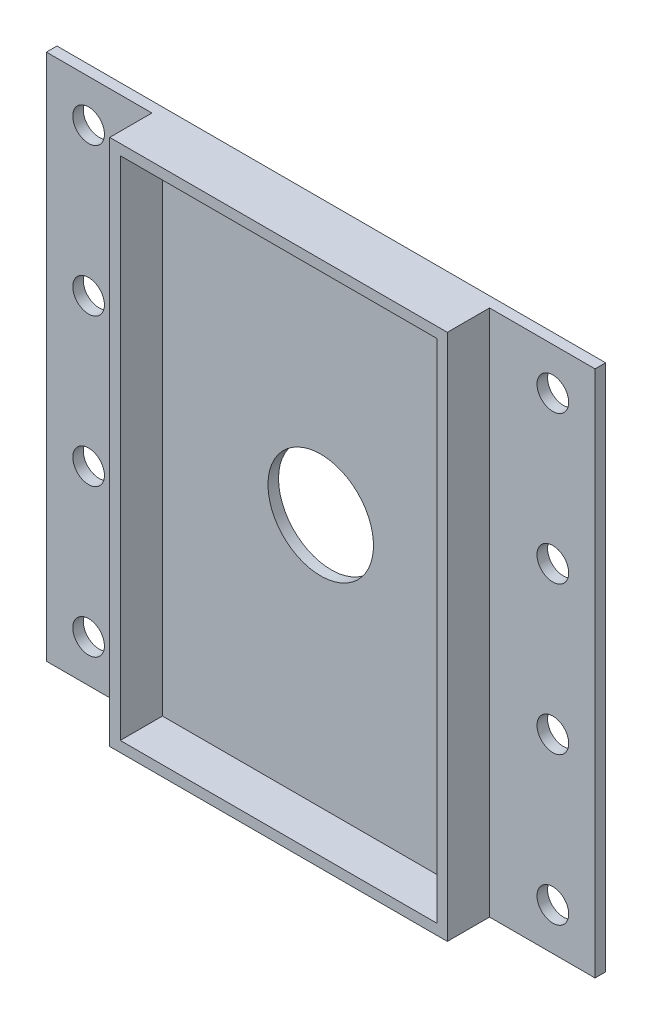
ISO-10303-21;
HEADER;
FILE_DESCRIPTION(('STEP AP214'),'2;1');
FILE_NAME('part.step','',(''),(''),'','','');
FILE_SCHEMA(('AUTOMOTIVE_DESIGN { 1 0 10303 214 1 1 1 1 }'));
ENDSEC;
DATA;
#1=APPLICATION_CONTEXT('core data for automotive mechanical design processes');
#2=APPLICATION_PROTOCOL_DEFINITION('international standard','automotive_design',2000,#1);
#3=PRODUCT_CONTEXT('',#1,'mechanical');
#4=PRODUCT('Part','Part','',(#3));
#5=PRODUCT_RELATED_PRODUCT_CATEGORY('part','',(#4));
#6=PRODUCT_DEFINITION_FORMATION('','',#4);
#7=PRODUCT_DEFINITION_CONTEXT('part definition',#1,'design');
#8=PRODUCT_DEFINITION('design','',#6,#7);
#9=PRODUCT_DEFINITION_SHAPE('','',#8);
#10=(LENGTH_UNIT() NAMED_UNIT(*) SI_UNIT(.MILLI.,.METRE.));
#11=(NAMED_UNIT(*) PLANE_ANGLE_UNIT() SI_UNIT($,.RADIAN.));
#12=(NAMED_UNIT(*) SI_UNIT($,.STERADIAN.) SOLID_ANGLE_UNIT());
#13=UNCERTAINTY_MEASURE_WITH_UNIT(LENGTH_MEASURE(1.E-05),#10,'distance_accuracy_value','');
#14=(GEOMETRIC_REPRESENTATION_CONTEXT(3) GLOBAL_UNCERTAINTY_ASSIGNED_CONTEXT((#13)) GLOBAL_UNIT_ASSIGNED_CONTEXT((#10,
#11,#12)) REPRESENTATION_CONTEXT('',''));
#15=CARTESIAN_POINT('',(0.,0.,0.));
#16=DIRECTION('',(0.,0.,1.));
#17=DIRECTION('',(1.,0.,0.));
#18=AXIS2_PLACEMENT_3D('',#15,#16,#17);
#19=CARTESIAN_POINT('',(0.,0.,20.));
#20=DIRECTION('',(0.,0.,1.));
#21=DIRECTION('',(1.,0.,0.));
#22=AXIS2_PLACEMENT_3D('',#19,#20,#21);
#23=PLANE('',#22);
#24=DIRECTION('',(0.,1.,0.));
#25=VECTOR('',#24,1.);
#26=CARTESIAN_POINT('',(0.,0.,20.));
#27=LINE('',#26,#25);
#28=CARTESIAN_POINT('',(0.,0.,20.));
#29=VERTEX_POINT('',#28);
#30=CARTESIAN_POINT('',(0.,250.,20.));
#31=VERTEX_POINT('',#30);
#32=EDGE_CURVE('E102',#29,#31,#27,.T.);
#33=ORIENTED_EDGE('',*,*,#32,.T.);
#34=DIRECTION('',(-1.,0.,0.));
#35=VECTOR('',#34,1.);
#36=CARTESIAN_POINT('',(0.,250.,20.));
#37=LINE('',#36,#35);
#38=CARTESIAN_POINT('',(-160.,250.,20.));
#39=VERTEX_POINT('',#38);
#40=EDGE_CURVE('E95',#31,#39,#37,.T.);
#41=ORIENTED_EDGE('',*,*,#40,.T.);
#42=DIRECTION('',(0.,-1.,0.));
#43=VECTOR('',#42,1.);
#44=CARTESIAN_POINT('',(-160.,0.,20.));
#45=LINE('',#44,#43);
#46=CARTESIAN_POINT('',(-160.,0.,20.));
#47=VERTEX_POINT('',#46);
#48=EDGE_CURVE('E99',#39,#47,#45,.T.);
#49=ORIENTED_EDGE('',*,*,#48,.T.);
#50=DIRECTION('',(1.,0.,0.));
#51=VECTOR('',#50,1.);
#52=CARTESIAN_POINT('',(0.,0.,20.));
#53=LINE('',#52,#51);
#54=EDGE_CURVE('E58',#47,#29,#53,.T.);
#55=ORIENTED_EDGE('',*,*,#54,.T.);
#56=EDGE_LOOP('',(#33,#41,#49,#55));
#57=FACE_BOUND('',#56,.T.);
#58=DIRECTION('',(-1.,0.,0.));
#59=VECTOR('',#58,1.);
#60=CARTESIAN_POINT('',(-5.,245.,20.));
#61=LINE('',#60,#59);
#62=CARTESIAN_POINT('',(-5.,245.,20.));
#63=VERTEX_POINT('',#62);
#64=CARTESIAN_POINT('',(-155.,245.,20.));
#65=VERTEX_POINT('',#64);
#66=EDGE_CURVE('E283',#63,#65,#61,.T.);
#67=ORIENTED_EDGE('',*,*,#66,.F.);
#68=DIRECTION('',(0.,1.,0.));
#69=VECTOR('',#68,1.);
#70=CARTESIAN_POINT('',(-5.,5.,20.));
#71=LINE('',#70,#69);
#72=CARTESIAN_POINT('',(-5.,5.,20.));
#73=VERTEX_POINT('',#72);
#74=EDGE_CURVE('E246',#73,#63,#71,.T.);
#75=ORIENTED_EDGE('',*,*,#74,.F.);
#76=DIRECTION('',(1.,0.,0.));
#77=VECTOR('',#76,1.);
#78=CARTESIAN_POINT('',(-5.,5.,20.));
#79=LINE('',#78,#77);
#80=CARTESIAN_POINT('',(-155.,4.99999999999998,20.));
#81=VERTEX_POINT('',#80);
#82=EDGE_CURVE('E79',#81,#73,#79,.T.);
#83=ORIENTED_EDGE('',*,*,#82,.F.);
#84=DIRECTION('',(0.,-1.,0.));
#85=VECTOR('',#84,1.);
#86=CARTESIAN_POINT('',(-155.,4.99999999999998,20.));
#87=LINE('',#86,#85);
#88=EDGE_CURVE('E288',#65,#81,#87,.T.);
#89=ORIENTED_EDGE('',*,*,#88,.F.);
#90=EDGE_LOOP('',(#67,#75,#83,#89));
#91=FACE_BOUND('',#90,.T.);
#92=ADVANCED_FACE('F32',(#57,#91),#23,.T.);
#93=CARTESIAN_POINT('',(0.,0.,20.));
#94=DIRECTION('',(-1.,0.,0.));
#95=DIRECTION('',(0.,0.,1.));
#96=AXIS2_PLACEMENT_3D('',#93,#94,#95);
#97=PLANE('',#96);
#98=DIRECTION('',(0.,1.,0.));
#99=VECTOR('',#98,1.);
#100=CARTESIAN_POINT('',(0.,0.,0.));
#101=LINE('',#100,#99);
#102=CARTESIAN_POINT('',(0.,0.,0.));
#103=VERTEX_POINT('',#102);
#104=CARTESIAN_POINT('',(0.,250.,0.));
#105=VERTEX_POINT('',#104);
#106=EDGE_CURVE('E128',#103,#105,#101,.T.);
#107=ORIENTED_EDGE('',*,*,#106,.T.);
#108=DIRECTION('',(0.,0.,-1.));
#109=VECTOR('',#108,1.);
#110=CARTESIAN_POINT('',(0.,250.,20.));
#111=LINE('',#110,#109);
#112=EDGE_CURVE('E11',#31,#105,#111,.T.);
#113=ORIENTED_EDGE('',*,*,#112,.F.);
#114=ORIENTED_EDGE('',*,*,#32,.F.);
#115=DIRECTION('',(0.,0.,-1.));
#116=VECTOR('',#115,1.);
#117=CARTESIAN_POINT('',(0.,0.,20.));
#118=LINE('',#117,#116);
#119=EDGE_CURVE('E119',#29,#103,#118,.T.);
#120=ORIENTED_EDGE('',*,*,#119,.T.);
#121=EDGE_LOOP('',(#107,#113,#114,#120));
#122=FACE_BOUND('',#121,.T.);
#123=ADVANCED_FACE('F34',(#122),#97,.F.);
#124=CARTESIAN_POINT('',(0.,250.,20.));
#125=DIRECTION('',(0.,-1.,0.));
#126=DIRECTION('',(1.,0.,0.));
#127=AXIS2_PLACEMENT_3D('',#124,#125,#126);
#128=PLANE('',#127);
#129=ORIENTED_EDGE('',*,*,#112,.T.);
#130=DIRECTION('',(1.,0.,0.));
#131=VECTOR('',#130,1.);
#132=CARTESIAN_POINT('',(50.,250.,0.));
#133=LINE('',#132,#131);
#134=CARTESIAN_POINT('',(50.,250.,0.));
#135=VERTEX_POINT('',#134);
#136=EDGE_CURVE('E210',#105,#135,#133,.T.);
#137=ORIENTED_EDGE('',*,*,#136,.T.);
#138=DIRECTION('',(0.,0.,1.));
#139=VECTOR('',#138,1.);
#140=CARTESIAN_POINT('',(50.,250.,-5.));
#141=LINE('',#140,#139);
#142=CARTESIAN_POINT('',(50.,250.,-5.));
#143=VERTEX_POINT('',#142);
#144=EDGE_CURVE('E196',#143,#135,#141,.T.);
#145=ORIENTED_EDGE('',*,*,#144,.F.);
#146=DIRECTION('',(1.,0.,0.));
#147=VECTOR('',#146,1.);
#148=CARTESIAN_POINT('',(50.,250.,-5.));
#149=LINE('',#148,#147);
#150=CARTESIAN_POINT('',(-210.,250.,-5.));
#151=VERTEX_POINT('',#150);
#152=EDGE_CURVE('E193',#151,#143,#149,.T.);
#153=ORIENTED_EDGE('',*,*,#152,.F.);
#154=DIRECTION('',(0.,0.,1.));
#155=VECTOR('',#154,1.);
#156=CARTESIAN_POINT('',(-210.,250.,-5.));
#157=LINE('',#156,#155);
#158=CARTESIAN_POINT('',(-210.,250.,0.));
#159=VERTEX_POINT('',#158);
#160=EDGE_CURVE('E219',#151,#159,#157,.T.);
#161=ORIENTED_EDGE('',*,*,#160,.T.);
#162=CARTESIAN_POINT('',(-160.,250.,0.));
#163=VERTEX_POINT('',#162);
#164=EDGE_CURVE('E112',#159,#163,#133,.T.);
#165=ORIENTED_EDGE('',*,*,#164,.T.);
#166=DIRECTION('',(0.,0.,-1.));
#167=VECTOR('',#166,1.);
#168=CARTESIAN_POINT('',(-160.,250.,20.));
#169=LINE('',#168,#167);
#170=EDGE_CURVE('E41',#39,#163,#169,.T.);
#171=ORIENTED_EDGE('',*,*,#170,.F.);
#172=ORIENTED_EDGE('',*,*,#40,.F.);
#173=EDGE_LOOP('',(#129,#137,#145,#153,#161,#165,#171,#172));
#174=FACE_BOUND('',#173,.T.);
#175=ADVANCED_FACE('F108',(#174),#128,.F.);
#176=CARTESIAN_POINT('',(-160.,0.,20.));
#177=DIRECTION('',(1.,0.,0.));
#178=DIRECTION('',(0.,0.,-1.));
#179=AXIS2_PLACEMENT_3D('',#176,#177,#178);
#180=PLANE('',#179);
#181=DIRECTION('',(0.,-1.,0.));
#182=VECTOR('',#181,1.);
#183=CARTESIAN_POINT('',(-160.,0.,0.));
#184=LINE('',#183,#182);
#185=CARTESIAN_POINT('',(-160.,0.,0.));
#186=VERTEX_POINT('',#185);
#187=EDGE_CURVE('E132',#163,#186,#184,.T.);
#188=ORIENTED_EDGE('',*,*,#187,.T.);
#189=DIRECTION('',(0.,0.,-1.));
#190=VECTOR('',#189,1.);
#191=CARTESIAN_POINT('',(-160.,0.,20.));
#192=LINE('',#191,#190);
#193=EDGE_CURVE('E114',#47,#186,#192,.T.);
#194=ORIENTED_EDGE('',*,*,#193,.F.);
#195=ORIENTED_EDGE('',*,*,#48,.F.);
#196=ORIENTED_EDGE('',*,*,#170,.T.);
#197=EDGE_LOOP('',(#188,#194,#195,#196));
#198=FACE_BOUND('',#197,.T.);
#199=ADVANCED_FACE('F116',(#198),#180,.F.);
#200=CARTESIAN_POINT('',(0.,0.,20.));
#201=DIRECTION('',(0.,1.,0.));
#202=DIRECTION('',(-1.,0.,0.));
#203=AXIS2_PLACEMENT_3D('',#200,#201,#202);
#204=PLANE('',#203);
#205=ORIENTED_EDGE('',*,*,#193,.T.);
#206=DIRECTION('',(-1.,0.,0.));
#207=VECTOR('',#206,1.);
#208=CARTESIAN_POINT('',(50.,0.,0.));
#209=LINE('',#208,#207);
#210=CARTESIAN_POINT('',(-210.,0.,0.));
#211=VERTEX_POINT('',#210);
#212=EDGE_CURVE('E71',#186,#211,#209,.T.);
#213=ORIENTED_EDGE('',*,*,#212,.T.);
#214=DIRECTION('',(0.,0.,1.));
#215=VECTOR('',#214,1.);
#216=CARTESIAN_POINT('',(-210.,0.,-5.));
#217=LINE('',#216,#215);
#218=CARTESIAN_POINT('',(-210.,0.,-5.));
#219=VERTEX_POINT('',#218);
#220=EDGE_CURVE('E221',#219,#211,#217,.T.);
#221=ORIENTED_EDGE('',*,*,#220,.F.);
#222=DIRECTION('',(-1.,0.,0.));
#223=VECTOR('',#222,1.);
#224=CARTESIAN_POINT('',(50.,0.,-5.));
#225=LINE('',#224,#223);
#226=CARTESIAN_POINT('',(50.,0.,-5.));
#227=VERTEX_POINT('',#226);
#228=EDGE_CURVE('E187',#227,#219,#225,.T.);
#229=ORIENTED_EDGE('',*,*,#228,.F.);
#230=DIRECTION('',(0.,0.,1.));
#231=VECTOR('',#230,1.);
#232=CARTESIAN_POINT('',(50.,0.,-5.));
#233=LINE('',#232,#231);
#234=CARTESIAN_POINT('',(50.,0.,0.));
#235=VERTEX_POINT('',#234);
#236=EDGE_CURVE('E223',#227,#235,#233,.T.);
#237=ORIENTED_EDGE('',*,*,#236,.T.);
#238=EDGE_CURVE('E207',#235,#103,#209,.T.);
#239=ORIENTED_EDGE('',*,*,#238,.T.);
#240=ORIENTED_EDGE('',*,*,#119,.F.);
#241=ORIENTED_EDGE('',*,*,#54,.F.);
#242=EDGE_LOOP('',(#205,#213,#221,#229,#237,#239,#240,#241));
#243=FACE_BOUND('',#242,.T.);
#244=ADVANCED_FACE('F258',(#243),#204,.F.);
#245=CARTESIAN_POINT('',(-5.,5.,20.));
#246=DIRECTION('',(-1.,0.,0.));
#247=DIRECTION('',(0.,0.,1.));
#248=AXIS2_PLACEMENT_3D('',#245,#246,#247);
#249=PLANE('',#248);
#250=DIRECTION('',(0.,1.,0.));
#251=VECTOR('',#250,1.);
#252=CARTESIAN_POINT('',(-5.,5.,0.));
#253=LINE('',#252,#251);
#254=CARTESIAN_POINT('',(-5.,5.,0.));
#255=VERTEX_POINT('',#254);
#256=CARTESIAN_POINT('',(-5.,245.,0.));
#257=VERTEX_POINT('',#256);
#258=EDGE_CURVE('E225',#255,#257,#253,.T.);
#259=ORIENTED_EDGE('',*,*,#258,.F.);
#260=DIRECTION('',(0.,0.,-1.));
#261=VECTOR('',#260,1.);
#262=CARTESIAN_POINT('',(-5.,5.,20.));
#263=LINE('',#262,#261);
#264=EDGE_CURVE('E247',#73,#255,#263,.T.);
#265=ORIENTED_EDGE('',*,*,#264,.F.);
#266=ORIENTED_EDGE('',*,*,#74,.T.);
#267=DIRECTION('',(0.,0.,-1.));
#268=VECTOR('',#267,1.);
#269=CARTESIAN_POINT('',(-5.,245.,20.));
#270=LINE('',#269,#268);
#271=EDGE_CURVE('E133',#63,#257,#270,.T.);
#272=ORIENTED_EDGE('',*,*,#271,.T.);
#273=EDGE_LOOP('',(#259,#265,#266,#272));
#274=FACE_BOUND('',#273,.T.);
#275=ADVANCED_FACE('F281',(#274),#249,.T.);
#276=CARTESIAN_POINT('',(-5.,245.,20.));
#277=DIRECTION('',(0.,-1.,0.));
#278=DIRECTION('',(1.,0.,0.));
#279=AXIS2_PLACEMENT_3D('',#276,#277,#278);
#280=PLANE('',#279);
#281=DIRECTION('',(-1.,0.,0.));
#282=VECTOR('',#281,1.);
#283=CARTESIAN_POINT('',(-5.,245.,0.));
#284=LINE('',#283,#282);
#285=CARTESIAN_POINT('',(-155.,245.,0.));
#286=VERTEX_POINT('',#285);
#287=EDGE_CURVE('E231',#257,#286,#284,.T.);
#288=ORIENTED_EDGE('',*,*,#287,.F.);
#289=ORIENTED_EDGE('',*,*,#271,.F.);
#290=ORIENTED_EDGE('',*,*,#66,.T.);
#291=DIRECTION('',(0.,0.,-1.));
#292=VECTOR('',#291,1.);
#293=CARTESIAN_POINT('',(-155.,245.,20.));
#294=LINE('',#293,#292);
#295=EDGE_CURVE('E250',#65,#286,#294,.T.);
#296=ORIENTED_EDGE('',*,*,#295,.T.);
#297=EDGE_LOOP('',(#288,#289,#290,#296));
#298=FACE_BOUND('',#297,.T.);
#299=ADVANCED_FACE('F285',(#298),#280,.T.);
#300=CARTESIAN_POINT('',(-155.,4.99999999999998,20.));
#301=DIRECTION('',(1.,0.,0.));
#302=DIRECTION('',(0.,0.,-1.));
#303=AXIS2_PLACEMENT_3D('',#300,#301,#302);
#304=PLANE('',#303);
#305=DIRECTION('',(0.,-1.,0.));
#306=VECTOR('',#305,1.);
#307=CARTESIAN_POINT('',(-155.,4.99999999999998,0.));
#308=LINE('',#307,#306);
#309=CARTESIAN_POINT('',(-155.,4.99999999999998,0.));
#310=VERTEX_POINT('',#309);
#311=EDGE_CURVE('E237',#286,#310,#308,.T.);
#312=ORIENTED_EDGE('',*,*,#311,.F.);
#313=ORIENTED_EDGE('',*,*,#295,.F.);
#314=ORIENTED_EDGE('',*,*,#88,.T.);
#315=DIRECTION('',(0.,0.,-1.));
#316=VECTOR('',#315,1.);
#317=CARTESIAN_POINT('',(-155.,4.99999999999998,20.));
#318=LINE('',#317,#316);
#319=EDGE_CURVE('E49',#81,#310,#318,.T.);
#320=ORIENTED_EDGE('',*,*,#319,.T.);
#321=EDGE_LOOP('',(#312,#313,#314,#320));
#322=FACE_BOUND('',#321,.T.);
#323=ADVANCED_FACE('F292',(#322),#304,.T.);
#324=CARTESIAN_POINT('',(-5.,5.,20.));
#325=DIRECTION('',(0.,1.,0.));
#326=DIRECTION('',(-1.,0.,0.));
#327=AXIS2_PLACEMENT_3D('',#324,#325,#326);
#328=PLANE('',#327);
#329=DIRECTION('',(1.,0.,0.));
#330=VECTOR('',#329,1.);
#331=CARTESIAN_POINT('',(-5.,5.,0.));
#332=LINE('',#331,#330);
#333=EDGE_CURVE('E244',#310,#255,#332,.T.);
#334=ORIENTED_EDGE('',*,*,#333,.F.);
#335=ORIENTED_EDGE('',*,*,#319,.F.);
#336=ORIENTED_EDGE('',*,*,#82,.T.);
#337=ORIENTED_EDGE('',*,*,#264,.T.);
#338=EDGE_LOOP('',(#334,#335,#336,#337));
#339=FACE_BOUND('',#338,.T.);
#340=ADVANCED_FACE('F296',(#339),#328,.T.);
#341=CARTESIAN_POINT('',(0.,0.,0.));
#342=DIRECTION('',(0.,0.,-1.));
#343=DIRECTION('',(-1.,0.,0.));
#344=AXIS2_PLACEMENT_3D('',#341,#342,#343);
#345=PLANE('',#344);
#346=CARTESIAN_POINT('',(-80.,125.,0.));
#347=DIRECTION('',(0.,0.,-1.));
#348=DIRECTION('',(-1.,0.,0.));
#349=AXIS2_PLACEMENT_3D('',#346,#347,#348);
#350=CIRCLE('',#349,25.);
#351=CARTESIAN_POINT('',(-105.,125.,0.));
#352=VERTEX_POINT('',#351);
#353=EDGE_CURVE('E178',#352,#352,#350,.T.);
#354=ORIENTED_EDGE('',*,*,#353,.T.);
#355=EDGE_LOOP('',(#354));
#356=FACE_BOUND('',#355,.T.);
#357=ORIENTED_EDGE('',*,*,#333,.T.);
#358=ORIENTED_EDGE('',*,*,#258,.T.);
#359=ORIENTED_EDGE('',*,*,#287,.T.);
#360=ORIENTED_EDGE('',*,*,#311,.T.);
#361=EDGE_LOOP('',(#357,#358,#359,#360));
#362=FACE_BOUND('',#361,.T.);
#363=ADVANCED_FACE('F293',(#356,#362),#345,.F.);
#364=CARTESIAN_POINT('',(30.,20.,0.));
#365=DIRECTION('',(0.,0.,1.));
#366=DIRECTION('',(1.,0.,0.));
#367=AXIS2_PLACEMENT_3D('',#364,#365,#366);
#368=CIRCLE('',#367,7.5);
#369=CARTESIAN_POINT('',(37.5,20.,0.));
#370=VERTEX_POINT('',#369);
#371=EDGE_CURVE('E499',#370,#370,#368,.T.);
#372=ORIENTED_EDGE('',*,*,#371,.F.);
#373=EDGE_LOOP('',(#372));
#374=FACE_BOUND('',#373,.T.);
#375=CARTESIAN_POINT('',(30.,90.,0.));
#376=DIRECTION('',(0.,0.,1.));
#377=DIRECTION('',(1.,0.,0.));
#378=AXIS2_PLACEMENT_3D('',#375,#376,#377);
#379=CIRCLE('',#378,7.5);
#380=CARTESIAN_POINT('',(37.5,90.,0.));
#381=VERTEX_POINT('',#380);
#382=EDGE_CURVE('E151',#381,#381,#379,.T.);
#383=ORIENTED_EDGE('',*,*,#382,.F.);
#384=EDGE_LOOP('',(#383));
#385=FACE_BOUND('',#384,.T.);
#386=CARTESIAN_POINT('',(30.,160.,0.));
#387=DIRECTION('',(0.,0.,1.));
#388=DIRECTION('',(1.,0.,0.));
#389=AXIS2_PLACEMENT_3D('',#386,#387,#388);
#390=CIRCLE('',#389,7.5);
#391=CARTESIAN_POINT('',(37.5,160.,0.));
#392=VERTEX_POINT('',#391);
#393=EDGE_CURVE('E147',#392,#392,#390,.T.);
#394=ORIENTED_EDGE('',*,*,#393,.F.);
#395=EDGE_LOOP('',(#394));
#396=FACE_BOUND('',#395,.T.);
#397=CARTESIAN_POINT('',(30.,230.,0.));
#398=DIRECTION('',(0.,0.,1.));
#399=DIRECTION('',(1.,0.,0.));
#400=AXIS2_PLACEMENT_3D('',#397,#398,#399);
#401=CIRCLE('',#400,7.5);
#402=CARTESIAN_POINT('',(37.5,230.,0.));
#403=VERTEX_POINT('',#402);
#404=EDGE_CURVE('E143',#403,#403,#401,.T.);
#405=ORIENTED_EDGE('',*,*,#404,.F.);
#406=EDGE_LOOP('',(#405));
#407=FACE_BOUND('',#406,.T.);
#408=ORIENTED_EDGE('',*,*,#106,.F.);
#409=ORIENTED_EDGE('',*,*,#238,.F.);
#410=DIRECTION('',(0.,-1.,0.));
#411=VECTOR('',#410,1.);
#412=CARTESIAN_POINT('',(50.,250.,0.));
#413=LINE('',#412,#411);
#414=EDGE_CURVE('E181',#135,#235,#413,.T.);
#415=ORIENTED_EDGE('',*,*,#414,.F.);
#416=ORIENTED_EDGE('',*,*,#136,.F.);
#417=EDGE_LOOP('',(#408,#409,#415,#416));
#418=FACE_BOUND('',#417,.T.);
#419=ADVANCED_FACE('F295',(#374,#385,#396,#407,#418),#345,.F.);
#420=CARTESIAN_POINT('',(50.,250.,-5.));
#421=DIRECTION('',(-1.,0.,0.));
#422=DIRECTION('',(0.,-1.,0.));
#423=AXIS2_PLACEMENT_3D('',#420,#421,#422);
#424=PLANE('',#423);
#425=ORIENTED_EDGE('',*,*,#414,.T.);
#426=ORIENTED_EDGE('',*,*,#236,.F.);
#427=DIRECTION('',(0.,-1.,0.));
#428=VECTOR('',#427,1.);
#429=CARTESIAN_POINT('',(50.,250.,-5.));
#430=LINE('',#429,#428);
#431=EDGE_CURVE('E184',#143,#227,#430,.T.);
#432=ORIENTED_EDGE('',*,*,#431,.F.);
#433=ORIENTED_EDGE('',*,*,#144,.T.);
#434=EDGE_LOOP('',(#425,#426,#432,#433));
#435=FACE_BOUND('',#434,.T.);
#436=ADVANCED_FACE('F304',(#435),#424,.F.);
#437=CARTESIAN_POINT('',(-210.,250.,-5.));
#438=DIRECTION('',(1.,0.,0.));
#439=DIRECTION('',(0.,1.,0.));
#440=AXIS2_PLACEMENT_3D('',#437,#438,#439);
#441=PLANE('',#440);
#442=DIRECTION('',(0.,1.,0.));
#443=VECTOR('',#442,1.);
#444=CARTESIAN_POINT('',(-210.,250.,0.));
#445=LINE('',#444,#443);
#446=EDGE_CURVE('E201',#211,#159,#445,.T.);
#447=ORIENTED_EDGE('',*,*,#446,.T.);
#448=ORIENTED_EDGE('',*,*,#160,.F.);
#449=DIRECTION('',(0.,1.,0.));
#450=VECTOR('',#449,1.);
#451=CARTESIAN_POINT('',(-210.,250.,-5.));
#452=LINE('',#451,#450);
#453=EDGE_CURVE('E190',#219,#151,#452,.T.);
#454=ORIENTED_EDGE('',*,*,#453,.F.);
#455=ORIENTED_EDGE('',*,*,#220,.T.);
#456=EDGE_LOOP('',(#447,#448,#454,#455));
#457=FACE_BOUND('',#456,.T.);
#458=ADVANCED_FACE('F366',(#457),#441,.F.);
#459=CARTESIAN_POINT('',(0.,0.,-5.));
#460=DIRECTION('',(0.,0.,-1.));
#461=DIRECTION('',(-1.,0.,0.));
#462=AXIS2_PLACEMENT_3D('',#459,#460,#461);
#463=PLANE('',#462);
#464=CARTESIAN_POINT('',(-190.,20.,-5.));
#465=DIRECTION('',(0.,0.,-1.));
#466=DIRECTION('',(-1.,0.,0.));
#467=AXIS2_PLACEMENT_3D('',#464,#465,#466);
#468=CIRCLE('',#467,7.50000000000001);
#469=CARTESIAN_POINT('',(-197.5,20.,-5.));
#470=VERTEX_POINT('',#469);
#471=EDGE_CURVE('E494',#470,#470,#468,.T.);
#472=ORIENTED_EDGE('',*,*,#471,.F.);
#473=EDGE_LOOP('',(#472));
#474=FACE_BOUND('',#473,.T.);
#475=CARTESIAN_POINT('',(30.,20.,-5.));
#476=DIRECTION('',(0.,0.,-1.));
#477=DIRECTION('',(-1.,0.,0.));
#478=AXIS2_PLACEMENT_3D('',#475,#476,#477);
#479=CIRCLE('',#478,7.5);
#480=CARTESIAN_POINT('',(22.5,20.,-5.));
#481=VERTEX_POINT('',#480);
#482=EDGE_CURVE('E36',#481,#481,#479,.T.);
#483=ORIENTED_EDGE('',*,*,#482,.F.);
#484=EDGE_LOOP('',(#483));
#485=FACE_BOUND('',#484,.T.);
#486=CARTESIAN_POINT('',(-190.,90.,-5.));
#487=DIRECTION('',(0.,0.,-1.));
#488=DIRECTION('',(-1.,0.,0.));
#489=AXIS2_PLACEMENT_3D('',#486,#487,#488);
#490=CIRCLE('',#489,7.50000000000001);
#491=CARTESIAN_POINT('',(-197.5,90.,-5.));
#492=VERTEX_POINT('',#491);
#493=EDGE_CURVE('E158',#492,#492,#490,.T.);
#494=ORIENTED_EDGE('',*,*,#493,.F.);
#495=EDGE_LOOP('',(#494));
#496=FACE_BOUND('',#495,.T.);
#497=CARTESIAN_POINT('',(30.,90.,-5.));
#498=DIRECTION('',(0.,0.,-1.));
#499=DIRECTION('',(-1.,0.,0.));
#500=AXIS2_PLACEMENT_3D('',#497,#498,#499);
#501=CIRCLE('',#500,7.5);
#502=CARTESIAN_POINT('',(22.5,90.,-5.));
#503=VERTEX_POINT('',#502);
#504=EDGE_CURVE('E148',#503,#503,#501,.T.);
#505=ORIENTED_EDGE('',*,*,#504,.F.);
#506=EDGE_LOOP('',(#505));
#507=FACE_BOUND('',#506,.T.);
#508=CARTESIAN_POINT('',(-190.,160.,-5.));
#509=DIRECTION('',(0.,0.,-1.));
#510=DIRECTION('',(-1.,0.,0.));
#511=AXIS2_PLACEMENT_3D('',#508,#509,#510);
#512=CIRCLE('',#511,7.50000000000001);
#513=CARTESIAN_POINT('',(-197.5,160.,-5.));
#514=VERTEX_POINT('',#513);
#515=EDGE_CURVE('E155',#514,#514,#512,.T.);
#516=ORIENTED_EDGE('',*,*,#515,.F.);
#517=EDGE_LOOP('',(#516));
#518=FACE_BOUND('',#517,.T.);
#519=CARTESIAN_POINT('',(30.,160.,-5.));
#520=DIRECTION('',(0.,0.,-1.));
#521=DIRECTION('',(-1.,0.,0.));
#522=AXIS2_PLACEMENT_3D('',#519,#520,#521);
#523=CIRCLE('',#522,7.5);
#524=CARTESIAN_POINT('',(22.5,160.,-5.));
#525=VERTEX_POINT('',#524);
#526=EDGE_CURVE('E144',#525,#525,#523,.T.);
#527=ORIENTED_EDGE('',*,*,#526,.F.);
#528=EDGE_LOOP('',(#527));
#529=FACE_BOUND('',#528,.T.);
#530=CARTESIAN_POINT('',(-190.,230.,-5.));
#531=DIRECTION('',(0.,0.,-1.));
#532=DIRECTION('',(-1.,0.,0.));
#533=AXIS2_PLACEMENT_3D('',#530,#531,#532);
#534=CIRCLE('',#533,7.50000000000001);
#535=CARTESIAN_POINT('',(-197.5,230.,-5.));
#536=VERTEX_POINT('',#535);
#537=EDGE_CURVE('E173',#536,#536,#534,.T.);
#538=ORIENTED_EDGE('',*,*,#537,.F.);
#539=EDGE_LOOP('',(#538));
#540=FACE_BOUND('',#539,.T.);
#541=CARTESIAN_POINT('',(30.,230.,-5.));
#542=DIRECTION('',(0.,0.,-1.));
#543=DIRECTION('',(-1.,0.,0.));
#544=AXIS2_PLACEMENT_3D('',#541,#542,#543);
#545=CIRCLE('',#544,7.5);
#546=CARTESIAN_POINT('',(22.5,230.,-5.));
#547=VERTEX_POINT('',#546);
#548=EDGE_CURVE('E139',#547,#547,#545,.T.);
#549=ORIENTED_EDGE('',*,*,#548,.F.);
#550=EDGE_LOOP('',(#549));
#551=FACE_BOUND('',#550,.T.);
#552=CARTESIAN_POINT('',(-80.,125.,-5.));
#553=DIRECTION('',(0.,0.,-1.));
#554=DIRECTION('',(-1.,0.,0.));
#555=AXIS2_PLACEMENT_3D('',#552,#553,#554);
#556=CIRCLE('',#555,25.);
#557=CARTESIAN_POINT('',(-105.,125.,-5.));
#558=VERTEX_POINT('',#557);
#559=EDGE_CURVE('E142',#558,#558,#556,.T.);
#560=ORIENTED_EDGE('',*,*,#559,.F.);
#561=EDGE_LOOP('',(#560));
#562=FACE_BOUND('',#561,.T.);
#563=ORIENTED_EDGE('',*,*,#431,.T.);
#564=ORIENTED_EDGE('',*,*,#228,.T.);
#565=ORIENTED_EDGE('',*,*,#453,.T.);
#566=ORIENTED_EDGE('',*,*,#152,.T.);
#567=EDGE_LOOP('',(#563,#564,#565,#566));
#568=FACE_BOUND('',#567,.T.);
#569=ADVANCED_FACE('F311',(#474,#485,#496,#507,#518,#529,#540,#551,#562,#568),#463,.T.);
#570=CARTESIAN_POINT('',(-190.,20.,0.));
#571=DIRECTION('',(0.,0.,1.));
#572=DIRECTION('',(1.,0.,0.));
#573=AXIS2_PLACEMENT_3D('',#570,#571,#572);
#574=CIRCLE('',#573,7.50000000000001);
#575=CARTESIAN_POINT('',(-182.5,20.,0.));
#576=VERTEX_POINT('',#575);
#577=EDGE_CURVE('E497',#576,#576,#574,.T.);
#578=ORIENTED_EDGE('',*,*,#577,.F.);
#579=EDGE_LOOP('',(#578));
#580=FACE_BOUND('',#579,.T.);
#581=CARTESIAN_POINT('',(-190.,90.,0.));
#582=DIRECTION('',(0.,0.,1.));
#583=DIRECTION('',(1.,0.,0.));
#584=AXIS2_PLACEMENT_3D('',#581,#582,#583);
#585=CIRCLE('',#584,7.50000000000001);
#586=CARTESIAN_POINT('',(-182.5,90.,0.));
#587=VERTEX_POINT('',#586);
#588=EDGE_CURVE('E163',#587,#587,#585,.T.);
#589=ORIENTED_EDGE('',*,*,#588,.F.);
#590=EDGE_LOOP('',(#589));
#591=FACE_BOUND('',#590,.T.);
#592=CARTESIAN_POINT('',(-190.,160.,0.));
#593=DIRECTION('',(0.,0.,1.));
#594=DIRECTION('',(1.,0.,0.));
#595=AXIS2_PLACEMENT_3D('',#592,#593,#594);
#596=CIRCLE('',#595,7.50000000000001);
#597=CARTESIAN_POINT('',(-182.5,160.,0.));
#598=VERTEX_POINT('',#597);
#599=EDGE_CURVE('E150',#598,#598,#596,.T.);
#600=ORIENTED_EDGE('',*,*,#599,.F.);
#601=EDGE_LOOP('',(#600));
#602=FACE_BOUND('',#601,.T.);
#603=CARTESIAN_POINT('',(-190.,230.,0.));
#604=DIRECTION('',(0.,0.,1.));
#605=DIRECTION('',(1.,0.,0.));
#606=AXIS2_PLACEMENT_3D('',#603,#604,#605);
#607=CIRCLE('',#606,7.50000000000001);
#608=CARTESIAN_POINT('',(-182.5,230.,0.));
#609=VERTEX_POINT('',#608);
#610=EDGE_CURVE('E146',#609,#609,#607,.T.);
#611=ORIENTED_EDGE('',*,*,#610,.F.);
#612=EDGE_LOOP('',(#611));
#613=FACE_BOUND('',#612,.T.);
#614=ORIENTED_EDGE('',*,*,#187,.F.);
#615=ORIENTED_EDGE('',*,*,#164,.F.);
#616=ORIENTED_EDGE('',*,*,#446,.F.);
#617=ORIENTED_EDGE('',*,*,#212,.F.);
#618=EDGE_LOOP('',(#614,#615,#616,#617));
#619=FACE_BOUND('',#618,.T.);
#620=ADVANCED_FACE('F299',(#580,#591,#602,#613,#619),#345,.F.);
#621=CARTESIAN_POINT('',(-80.,125.,0.));
#622=DIRECTION('',(0.,0.,-1.));
#623=DIRECTION('',(-1.,0.,0.));
#624=AXIS2_PLACEMENT_3D('',#621,#622,#623);
#625=CYLINDRICAL_SURFACE('',#624,25.);
#626=ORIENTED_EDGE('',*,*,#353,.F.);
#627=EDGE_LOOP('',(#626));
#628=FACE_BOUND('',#627,.T.);
#629=ORIENTED_EDGE('',*,*,#559,.T.);
#630=EDGE_LOOP('',(#629));
#631=FACE_BOUND('',#630,.T.);
#632=ADVANCED_FACE('F310',(#628,#631),#625,.F.);
#633=CARTESIAN_POINT('',(30.,230.,-10.));
#634=DIRECTION('',(0.,0.,1.));
#635=DIRECTION('',(1.,0.,0.));
#636=AXIS2_PLACEMENT_3D('',#633,#634,#635);
#637=CYLINDRICAL_SURFACE('',#636,7.5);
#638=ORIENTED_EDGE('',*,*,#548,.T.);
#639=EDGE_LOOP('',(#638));
#640=FACE_BOUND('',#639,.T.);
#641=ORIENTED_EDGE('',*,*,#404,.T.);
#642=EDGE_LOOP('',(#641));
#643=FACE_BOUND('',#642,.T.);
#644=ADVANCED_FACE('F391',(#640,#643),#637,.F.);
#645=CARTESIAN_POINT('',(-190.,230.,-10.));
#646=DIRECTION('',(0.,0.,1.));
#647=DIRECTION('',(1.,0.,0.));
#648=AXIS2_PLACEMENT_3D('',#645,#646,#647);
#649=CYLINDRICAL_SURFACE('',#648,7.50000000000001);
#650=ORIENTED_EDGE('',*,*,#537,.T.);
#651=EDGE_LOOP('',(#650));
#652=FACE_BOUND('',#651,.T.);
#653=ORIENTED_EDGE('',*,*,#610,.T.);
#654=EDGE_LOOP('',(#653));
#655=FACE_BOUND('',#654,.T.);
#656=ADVANCED_FACE('F418',(#652,#655),#649,.F.);
#657=CARTESIAN_POINT('',(30.,160.,-10.));
#658=DIRECTION('',(0.,0.,1.));
#659=DIRECTION('',(1.,0.,0.));
#660=AXIS2_PLACEMENT_3D('',#657,#658,#659);
#661=CYLINDRICAL_SURFACE('',#660,7.5);
#662=ORIENTED_EDGE('',*,*,#526,.T.);
#663=EDGE_LOOP('',(#662));
#664=FACE_BOUND('',#663,.T.);
#665=ORIENTED_EDGE('',*,*,#393,.T.);
#666=EDGE_LOOP('',(#665));
#667=FACE_BOUND('',#666,.T.);
#668=ADVANCED_FACE('F428',(#664,#667),#661,.F.);
#669=CARTESIAN_POINT('',(-190.,160.,-10.));
#670=DIRECTION('',(0.,0.,1.));
#671=DIRECTION('',(1.,0.,0.));
#672=AXIS2_PLACEMENT_3D('',#669,#670,#671);
#673=CYLINDRICAL_SURFACE('',#672,7.50000000000001);
#674=ORIENTED_EDGE('',*,*,#515,.T.);
#675=EDGE_LOOP('',(#674));
#676=FACE_BOUND('',#675,.T.);
#677=ORIENTED_EDGE('',*,*,#599,.T.);
#678=EDGE_LOOP('',(#677));
#679=FACE_BOUND('',#678,.T.);
#680=ADVANCED_FACE('F438',(#676,#679),#673,.F.);
#681=CARTESIAN_POINT('',(30.,90.,-10.));
#682=DIRECTION('',(0.,0.,1.));
#683=DIRECTION('',(1.,0.,0.));
#684=AXIS2_PLACEMENT_3D('',#681,#682,#683);
#685=CYLINDRICAL_SURFACE('',#684,7.5);
#686=ORIENTED_EDGE('',*,*,#504,.T.);
#687=EDGE_LOOP('',(#686));
#688=FACE_BOUND('',#687,.T.);
#689=ORIENTED_EDGE('',*,*,#382,.T.);
#690=EDGE_LOOP('',(#689));
#691=FACE_BOUND('',#690,.T.);
#692=ADVANCED_FACE('F448',(#688,#691),#685,.F.);
#693=CARTESIAN_POINT('',(-190.,90.,-10.));
#694=DIRECTION('',(0.,0.,1.));
#695=DIRECTION('',(1.,0.,0.));
#696=AXIS2_PLACEMENT_3D('',#693,#694,#695);
#697=CYLINDRICAL_SURFACE('',#696,7.50000000000001);
#698=ORIENTED_EDGE('',*,*,#493,.T.);
#699=EDGE_LOOP('',(#698));
#700=FACE_BOUND('',#699,.T.);
#701=ORIENTED_EDGE('',*,*,#588,.T.);
#702=EDGE_LOOP('',(#701));
#703=FACE_BOUND('',#702,.T.);
#704=ADVANCED_FACE('F458',(#700,#703),#697,.F.);
#705=CARTESIAN_POINT('',(30.,20.,-10.));
#706=DIRECTION('',(0.,0.,1.));
#707=DIRECTION('',(1.,0.,0.));
#708=AXIS2_PLACEMENT_3D('',#705,#706,#707);
#709=CYLINDRICAL_SURFACE('',#708,7.5);
#710=ORIENTED_EDGE('',*,*,#482,.T.);
#711=EDGE_LOOP('',(#710));
#712=FACE_BOUND('',#711,.T.);
#713=ORIENTED_EDGE('',*,*,#371,.T.);
#714=EDGE_LOOP('',(#713));
#715=FACE_BOUND('',#714,.T.);
#716=ADVANCED_FACE('F467',(#712,#715),#709,.F.);
#717=CARTESIAN_POINT('',(-190.,20.,-10.));
#718=DIRECTION('',(0.,0.,1.));
#719=DIRECTION('',(1.,0.,0.));
#720=AXIS2_PLACEMENT_3D('',#717,#718,#719);
#721=CYLINDRICAL_SURFACE('',#720,7.50000000000001);
#722=ORIENTED_EDGE('',*,*,#471,.T.);
#723=EDGE_LOOP('',(#722));
#724=FACE_BOUND('',#723,.T.);
#725=ORIENTED_EDGE('',*,*,#577,.T.);
#726=EDGE_LOOP('',(#725));
#727=FACE_BOUND('',#726,.T.);
#728=ADVANCED_FACE('F477',(#724,#727),#721,.F.);
#729=CLOSED_SHELL('',(#92,#123,#175,#199,#244,#275,#299,#323,#340,#363,#419,#436,#458,#569,#620,
#632,#644,#656,#668,#680,#692,#704,#716,#728));
#730=MANIFOLD_SOLID_BREP('B2',#729);
#731=ADVANCED_BREP_SHAPE_REPRESENTATION('',(#18,#730),#14);
#732=SHAPE_DEFINITION_REPRESENTATION(#9,#731);
ENDSEC;
END-ISO-10303-21;
